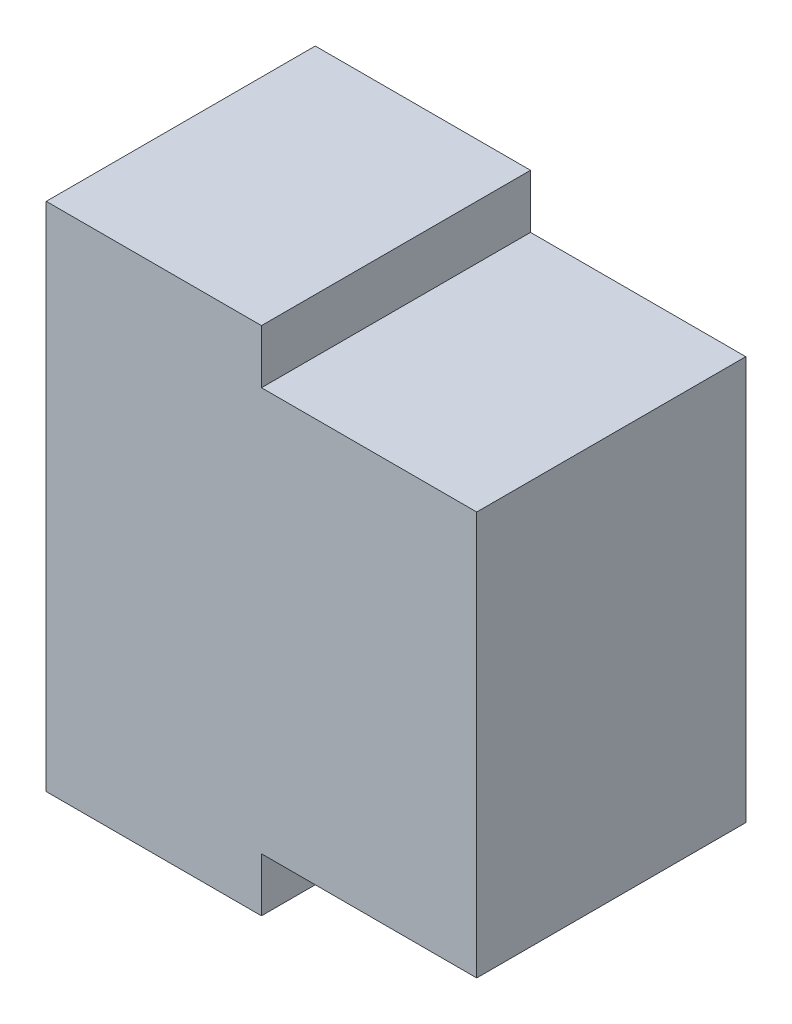
ISO-10303-21;
HEADER;
FILE_DESCRIPTION(('STEP AP214'),'2;1');
FILE_NAME('part.step','',(''),(''),'','','');
FILE_SCHEMA(('AUTOMOTIVE_DESIGN { 1 0 10303 214 1 1 1 1 }'));
ENDSEC;
DATA;
#1=APPLICATION_CONTEXT('core data for automotive mechanical design processes');
#2=APPLICATION_PROTOCOL_DEFINITION('international standard','automotive_design',2000,#1);
#3=PRODUCT_CONTEXT('',#1,'mechanical');
#4=PRODUCT('Part','Part','',(#3));
#5=PRODUCT_RELATED_PRODUCT_CATEGORY('part','',(#4));
#6=PRODUCT_DEFINITION_FORMATION('','',#4);
#7=PRODUCT_DEFINITION_CONTEXT('part definition',#1,'design');
#8=PRODUCT_DEFINITION('design','',#6,#7);
#9=PRODUCT_DEFINITION_SHAPE('','',#8);
#10=(LENGTH_UNIT() NAMED_UNIT(*) SI_UNIT(.MILLI.,.METRE.));
#11=(NAMED_UNIT(*) PLANE_ANGLE_UNIT() SI_UNIT($,.RADIAN.));
#12=(NAMED_UNIT(*) SI_UNIT($,.STERADIAN.) SOLID_ANGLE_UNIT());
#13=UNCERTAINTY_MEASURE_WITH_UNIT(LENGTH_MEASURE(1.E-05),#10,'distance_accuracy_value','');
#14=(GEOMETRIC_REPRESENTATION_CONTEXT(3) GLOBAL_UNCERTAINTY_ASSIGNED_CONTEXT((#13)) GLOBAL_UNIT_ASSIGNED_CONTEXT((#10,
#11,#12)) REPRESENTATION_CONTEXT('',''));
#15=CARTESIAN_POINT('',(0.,0.,0.));
#16=DIRECTION('',(0.,0.,1.));
#17=DIRECTION('',(1.,0.,0.));
#18=AXIS2_PLACEMENT_3D('',#15,#16,#17);
#19=CARTESIAN_POINT('',(-2.66142857142855,0.,0.925));
#20=DIRECTION('',(0.,0.,1.));
#21=DIRECTION('',(1.,0.,0.));
#22=AXIS2_PLACEMENT_3D('',#19,#20,#21);
#23=PLANE('',#22);
#24=DIRECTION('',(0.,-1.,0.));
#25=VECTOR('',#24,1.);
#26=CARTESIAN_POINT('',(-3.03,0.475000000000082,0.925));
#27=LINE('',#26,#25);
#28=CARTESIAN_POINT('',(-3.03,0.475000000000082,0.925));
#29=VERTEX_POINT('',#28);
#30=CARTESIAN_POINT('',(-3.03,-0.475000000000021,0.925));
#31=VERTEX_POINT('',#30);
#32=EDGE_CURVE('E20',#29,#31,#27,.T.);
#33=ORIENTED_EDGE('',*,*,#32,.F.);
#34=DIRECTION('',(-1.,0.,0.));
#35=VECTOR('',#34,1.);
#36=CARTESIAN_POINT('',(-2.78,0.475000000000081,0.925));
#37=LINE('',#36,#35);
#38=CARTESIAN_POINT('',(-2.63,0.475000000000081,0.925));
#39=VERTEX_POINT('',#38);
#40=EDGE_CURVE('E197',#39,#29,#37,.T.);
#41=ORIENTED_EDGE('',*,*,#40,.F.);
#42=DIRECTION('',(0.,1.,0.));
#43=VECTOR('',#42,1.);
#44=CARTESIAN_POINT('',(-2.63,0.375,0.925));
#45=LINE('',#44,#43);
#46=CARTESIAN_POINT('',(-2.63,0.375,0.925));
#47=VERTEX_POINT('',#46);
#48=EDGE_CURVE('E208',#47,#39,#45,.T.);
#49=ORIENTED_EDGE('',*,*,#48,.F.);
#50=DIRECTION('',(-1.,0.,0.));
#51=VECTOR('',#50,1.);
#52=CARTESIAN_POINT('',(-2.22999999999996,0.375,0.925));
#53=LINE('',#52,#51);
#54=CARTESIAN_POINT('',(-2.22999999999996,0.375,0.925));
#55=VERTEX_POINT('',#54);
#56=EDGE_CURVE('E135',#55,#47,#53,.T.);
#57=ORIENTED_EDGE('',*,*,#56,.F.);
#58=DIRECTION('',(0.,1.,0.));
#59=VECTOR('',#58,1.);
#60=CARTESIAN_POINT('',(-2.22999999999996,-0.375,0.925));
#61=LINE('',#60,#59);
#62=CARTESIAN_POINT('',(-2.22999999999996,-0.375,0.925));
#63=VERTEX_POINT('',#62);
#64=EDGE_CURVE('E120',#63,#55,#61,.T.);
#65=ORIENTED_EDGE('',*,*,#64,.F.);
#66=DIRECTION('',(1.,0.,0.));
#67=VECTOR('',#66,1.);
#68=CARTESIAN_POINT('',(-2.78,-0.375,0.925));
#69=LINE('',#68,#67);
#70=CARTESIAN_POINT('',(-2.63,-0.375,0.925));
#71=VERTEX_POINT('',#70);
#72=EDGE_CURVE('E144',#71,#63,#69,.T.);
#73=ORIENTED_EDGE('',*,*,#72,.F.);
#74=DIRECTION('',(0.,1.,0.));
#75=VECTOR('',#74,1.);
#76=CARTESIAN_POINT('',(-2.63,0.375,0.925));
#77=LINE('',#76,#75);
#78=CARTESIAN_POINT('',(-2.63,-0.475000000000021,0.925));
#79=VERTEX_POINT('',#78);
#80=EDGE_CURVE('E93',#79,#71,#77,.T.);
#81=ORIENTED_EDGE('',*,*,#80,.F.);
#82=DIRECTION('',(1.,0.,0.));
#83=VECTOR('',#82,1.);
#84=CARTESIAN_POINT('',(-3.03,-0.475000000000021,0.925));
#85=LINE('',#84,#83);
#86=EDGE_CURVE('E161',#31,#79,#85,.T.);
#87=ORIENTED_EDGE('',*,*,#86,.F.);
#88=EDGE_LOOP('',(#33,#41,#49,#57,#65,#73,#81,#87));
#89=FACE_BOUND('',#88,.T.);
#90=ADVANCED_FACE('F17',(#89),#23,.F.);
#91=CARTESIAN_POINT('',(-2.66142857142855,0.,1.425));
#92=DIRECTION('',(0.,0.,1.));
#93=DIRECTION('',(1.,0.,0.));
#94=AXIS2_PLACEMENT_3D('',#91,#92,#93);
#95=PLANE('',#94);
#96=DIRECTION('',(0.,-1.,0.));
#97=VECTOR('',#96,1.);
#98=CARTESIAN_POINT('',(-3.03,0.475000000000082,1.425));
#99=LINE('',#98,#97);
#100=CARTESIAN_POINT('',(-3.03,0.475000000000082,1.425));
#101=VERTEX_POINT('',#100);
#102=CARTESIAN_POINT('',(-3.03,-0.475000000000021,1.425));
#103=VERTEX_POINT('',#102);
#104=EDGE_CURVE('E11',#101,#103,#99,.T.);
#105=ORIENTED_EDGE('',*,*,#104,.T.);
#106=DIRECTION('',(1.,0.,0.));
#107=VECTOR('',#106,1.);
#108=CARTESIAN_POINT('',(-3.03,-0.475000000000021,1.425));
#109=LINE('',#108,#107);
#110=CARTESIAN_POINT('',(-2.63,-0.475000000000021,1.425));
#111=VERTEX_POINT('',#110);
#112=EDGE_CURVE('E164',#103,#111,#109,.T.);
#113=ORIENTED_EDGE('',*,*,#112,.T.);
#114=DIRECTION('',(0.,1.,0.));
#115=VECTOR('',#114,1.);
#116=CARTESIAN_POINT('',(-2.63,0.,1.425));
#117=LINE('',#116,#115);
#118=CARTESIAN_POINT('',(-2.63,-0.375,1.425));
#119=VERTEX_POINT('',#118);
#120=EDGE_CURVE('E153',#111,#119,#117,.T.);
#121=ORIENTED_EDGE('',*,*,#120,.T.);
#122=DIRECTION('',(1.,0.,0.));
#123=VECTOR('',#122,1.);
#124=CARTESIAN_POINT('',(-2.78,-0.375,1.425));
#125=LINE('',#124,#123);
#126=CARTESIAN_POINT('',(-2.22999999999996,-0.375,1.425));
#127=VERTEX_POINT('',#126);
#128=EDGE_CURVE('E80',#119,#127,#125,.T.);
#129=ORIENTED_EDGE('',*,*,#128,.T.);
#130=DIRECTION('',(0.,1.,0.));
#131=VECTOR('',#130,1.);
#132=CARTESIAN_POINT('',(-2.22999999999996,-0.375,1.425));
#133=LINE('',#132,#131);
#134=CARTESIAN_POINT('',(-2.22999999999996,0.375,1.425));
#135=VERTEX_POINT('',#134);
#136=EDGE_CURVE('E109',#127,#135,#133,.T.);
#137=ORIENTED_EDGE('',*,*,#136,.T.);
#138=DIRECTION('',(-1.,0.,0.));
#139=VECTOR('',#138,1.);
#140=CARTESIAN_POINT('',(-2.22999999999996,0.375,1.425));
#141=LINE('',#140,#139);
#142=CARTESIAN_POINT('',(-2.63,0.375,1.425));
#143=VERTEX_POINT('',#142);
#144=EDGE_CURVE('E114',#135,#143,#141,.T.);
#145=ORIENTED_EDGE('',*,*,#144,.T.);
#146=DIRECTION('',(0.,1.,0.));
#147=VECTOR('',#146,1.);
#148=CARTESIAN_POINT('',(-2.63,0.375,1.425));
#149=LINE('',#148,#147);
#150=CARTESIAN_POINT('',(-2.63,0.475000000000081,1.425));
#151=VERTEX_POINT('',#150);
#152=EDGE_CURVE('E210',#143,#151,#149,.T.);
#153=ORIENTED_EDGE('',*,*,#152,.T.);
#154=DIRECTION('',(-1.,0.,0.));
#155=VECTOR('',#154,1.);
#156=CARTESIAN_POINT('',(-2.78,0.475000000000081,1.425));
#157=LINE('',#156,#155);
#158=EDGE_CURVE('E201',#151,#101,#157,.T.);
#159=ORIENTED_EDGE('',*,*,#158,.T.);
#160=EDGE_LOOP('',(#105,#113,#121,#129,#137,#145,#153,#159));
#161=FACE_BOUND('',#160,.T.);
#162=ADVANCED_FACE('F111',(#161),#95,.T.);
#163=CARTESIAN_POINT('',(-3.03,0.475000000000082,0.925));
#164=DIRECTION('',(-1.,0.,0.));
#165=DIRECTION('',(0.,1.,0.));
#166=AXIS2_PLACEMENT_3D('',#163,#164,#165);
#167=PLANE('',#166);
#168=ORIENTED_EDGE('',*,*,#32,.T.);
#169=DIRECTION('',(0.,0.,1.));
#170=VECTOR('',#169,1.);
#171=CARTESIAN_POINT('',(-3.03,-0.475000000000021,0.925));
#172=LINE('',#171,#170);
#173=EDGE_CURVE('E166',#31,#103,#172,.T.);
#174=ORIENTED_EDGE('',*,*,#173,.T.);
#175=ORIENTED_EDGE('',*,*,#104,.F.);
#176=DIRECTION('',(0.,0.,1.));
#177=VECTOR('',#176,1.);
#178=CARTESIAN_POINT('',(-3.03,0.475000000000082,0.925));
#179=LINE('',#178,#177);
#180=EDGE_CURVE('E179',#29,#101,#179,.T.);
#181=ORIENTED_EDGE('',*,*,#180,.F.);
#182=EDGE_LOOP('',(#168,#174,#175,#181));
#183=FACE_BOUND('',#182,.T.);
#184=ADVANCED_FACE('F177',(#183),#167,.T.);
#185=CARTESIAN_POINT('',(-3.03,-0.475000000000021,0.925));
#186=DIRECTION('',(0.,-1.,0.));
#187=DIRECTION('',(-1.,0.,0.));
#188=AXIS2_PLACEMENT_3D('',#185,#186,#187);
#189=PLANE('',#188);
#190=ORIENTED_EDGE('',*,*,#86,.T.);
#191=DIRECTION('',(0.,0.,1.));
#192=VECTOR('',#191,1.);
#193=CARTESIAN_POINT('',(-2.63,-0.475000000000021,0.925));
#194=LINE('',#193,#192);
#195=EDGE_CURVE('E157',#79,#111,#194,.T.);
#196=ORIENTED_EDGE('',*,*,#195,.T.);
#197=ORIENTED_EDGE('',*,*,#112,.F.);
#198=ORIENTED_EDGE('',*,*,#173,.F.);
#199=EDGE_LOOP('',(#190,#196,#197,#198));
#200=FACE_BOUND('',#199,.T.);
#201=ADVANCED_FACE('F185',(#200),#189,.T.);
#202=CARTESIAN_POINT('',(-2.63,0.375,0.925));
#203=DIRECTION('',(1.,0.,0.));
#204=DIRECTION('',(0.,-1.,0.));
#205=AXIS2_PLACEMENT_3D('',#202,#203,#204);
#206=PLANE('',#205);
#207=ORIENTED_EDGE('',*,*,#80,.T.);
#208=DIRECTION('',(0.,0.,1.));
#209=VECTOR('',#208,1.);
#210=CARTESIAN_POINT('',(-2.63,-0.375,0.925));
#211=LINE('',#210,#209);
#212=EDGE_CURVE('E154',#71,#119,#211,.T.);
#213=ORIENTED_EDGE('',*,*,#212,.T.);
#214=ORIENTED_EDGE('',*,*,#120,.F.);
#215=ORIENTED_EDGE('',*,*,#195,.F.);
#216=EDGE_LOOP('',(#207,#213,#214,#215));
#217=FACE_BOUND('',#216,.T.);
#218=ADVANCED_FACE('F381',(#217),#206,.T.);
#219=CARTESIAN_POINT('',(-2.78,-0.375,0.925));
#220=DIRECTION('',(0.,-1.,0.));
#221=DIRECTION('',(-1.,0.,0.));
#222=AXIS2_PLACEMENT_3D('',#219,#220,#221);
#223=PLANE('',#222);
#224=ORIENTED_EDGE('',*,*,#72,.T.);
#225=DIRECTION('',(0.,0.,1.));
#226=VECTOR('',#225,1.);
#227=CARTESIAN_POINT('',(-2.22999999999996,-0.375,0.925));
#228=LINE('',#227,#226);
#229=EDGE_CURVE('E119',#63,#127,#228,.T.);
#230=ORIENTED_EDGE('',*,*,#229,.T.);
#231=ORIENTED_EDGE('',*,*,#128,.F.);
#232=ORIENTED_EDGE('',*,*,#212,.F.);
#233=EDGE_LOOP('',(#224,#230,#231,#232));
#234=FACE_BOUND('',#233,.T.);
#235=ADVANCED_FACE('F188',(#234),#223,.T.);
#236=CARTESIAN_POINT('',(-2.22999999999996,-0.375,0.925));
#237=DIRECTION('',(1.,0.,0.));
#238=DIRECTION('',(0.,1.,0.));
#239=AXIS2_PLACEMENT_3D('',#236,#237,#238);
#240=PLANE('',#239);
#241=ORIENTED_EDGE('',*,*,#64,.T.);
#242=DIRECTION('',(0.,0.,1.));
#243=VECTOR('',#242,1.);
#244=CARTESIAN_POINT('',(-2.22999999999996,0.375,0.925));
#245=LINE('',#244,#243);
#246=EDGE_CURVE('E123',#55,#135,#245,.T.);
#247=ORIENTED_EDGE('',*,*,#246,.T.);
#248=ORIENTED_EDGE('',*,*,#136,.F.);
#249=ORIENTED_EDGE('',*,*,#229,.F.);
#250=EDGE_LOOP('',(#241,#247,#248,#249));
#251=FACE_BOUND('',#250,.T.);
#252=ADVANCED_FACE('F124',(#251),#240,.T.);
#253=CARTESIAN_POINT('',(-2.22999999999996,0.375,0.925));
#254=DIRECTION('',(0.,1.,0.));
#255=DIRECTION('',(1.,0.,0.));
#256=AXIS2_PLACEMENT_3D('',#253,#254,#255);
#257=PLANE('',#256);
#258=ORIENTED_EDGE('',*,*,#56,.T.);
#259=DIRECTION('',(0.,0.,1.));
#260=VECTOR('',#259,1.);
#261=CARTESIAN_POINT('',(-2.63,0.375,0.925));
#262=LINE('',#261,#260);
#263=EDGE_CURVE('E132',#47,#143,#262,.T.);
#264=ORIENTED_EDGE('',*,*,#263,.T.);
#265=ORIENTED_EDGE('',*,*,#144,.F.);
#266=ORIENTED_EDGE('',*,*,#246,.F.);
#267=EDGE_LOOP('',(#258,#264,#265,#266));
#268=FACE_BOUND('',#267,.T.);
#269=ADVANCED_FACE('F130',(#268),#257,.T.);
#270=CARTESIAN_POINT('',(-2.63,0.375,0.925));
#271=DIRECTION('',(1.,0.,0.));
#272=DIRECTION('',(0.,-1.,0.));
#273=AXIS2_PLACEMENT_3D('',#270,#271,#272);
#274=PLANE('',#273);
#275=ORIENTED_EDGE('',*,*,#48,.T.);
#276=DIRECTION('',(0.,0.,1.));
#277=VECTOR('',#276,1.);
#278=CARTESIAN_POINT('',(-2.63,0.475000000000081,0.925));
#279=LINE('',#278,#277);
#280=EDGE_CURVE('E203',#39,#151,#279,.T.);
#281=ORIENTED_EDGE('',*,*,#280,.T.);
#282=ORIENTED_EDGE('',*,*,#152,.F.);
#283=ORIENTED_EDGE('',*,*,#263,.F.);
#284=EDGE_LOOP('',(#275,#281,#282,#283));
#285=FACE_BOUND('',#284,.T.);
#286=ADVANCED_FACE('F322',(#285),#274,.T.);
#287=CARTESIAN_POINT('',(-2.78,0.475000000000081,0.925));
#288=DIRECTION('',(0.,1.,0.));
#289=DIRECTION('',(1.,0.,0.));
#290=AXIS2_PLACEMENT_3D('',#287,#288,#289);
#291=PLANE('',#290);
#292=ORIENTED_EDGE('',*,*,#40,.T.);
#293=ORIENTED_EDGE('',*,*,#180,.T.);
#294=ORIENTED_EDGE('',*,*,#158,.F.);
#295=ORIENTED_EDGE('',*,*,#280,.F.);
#296=EDGE_LOOP('',(#292,#293,#294,#295));
#297=FACE_BOUND('',#296,.T.);
#298=ADVANCED_FACE('F317',(#297),#291,.T.);
#299=CLOSED_SHELL('',(#90,#162,#184,#201,#218,#235,#252,#269,#286,#298));
#300=MANIFOLD_SOLID_BREP('B1',#299);
#301=ADVANCED_BREP_SHAPE_REPRESENTATION('',(#18,#300),#14);
#302=SHAPE_DEFINITION_REPRESENTATION(#9,#301);
ENDSEC;
END-ISO-10303-21;
